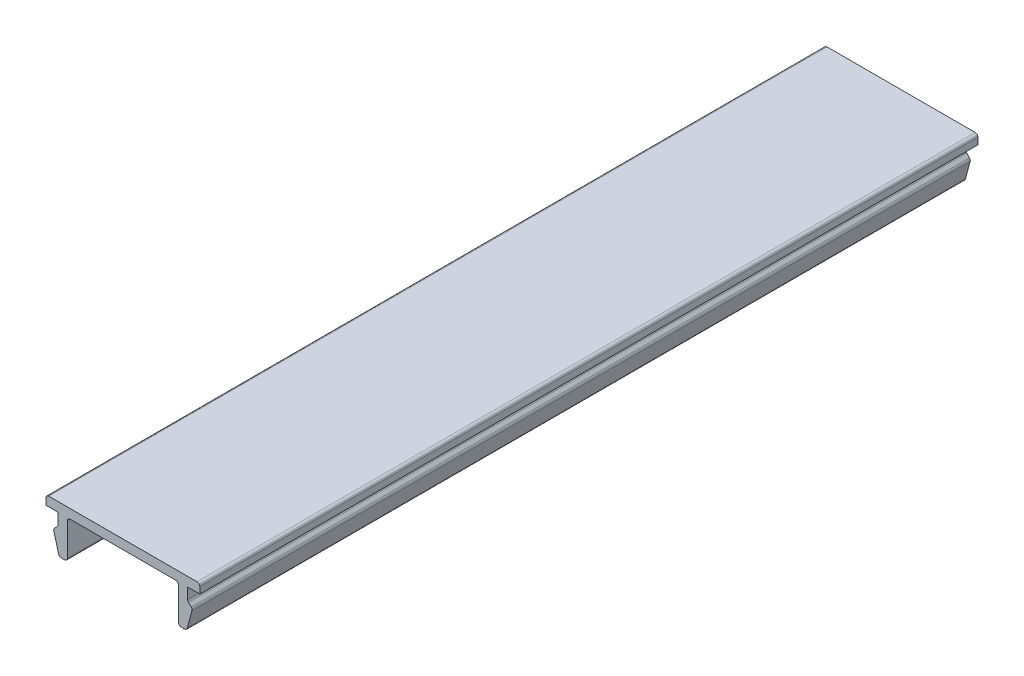
ISO-10303-21;
HEADER;
FILE_DESCRIPTION(('STEP AP214'),'2;1');
FILE_NAME('part.step','',(''),(''),'','','');
FILE_SCHEMA(('AUTOMOTIVE_DESIGN { 1 0 10303 214 1 1 1 1 }'));
ENDSEC;
DATA;
#1=APPLICATION_CONTEXT('core data for automotive mechanical design processes');
#2=APPLICATION_PROTOCOL_DEFINITION('international standard','automotive_design',2000,#1);
#3=PRODUCT_CONTEXT('',#1,'mechanical');
#4=PRODUCT('Part','Part','',(#3));
#5=PRODUCT_RELATED_PRODUCT_CATEGORY('part','',(#4));
#6=PRODUCT_DEFINITION_FORMATION('','',#4);
#7=PRODUCT_DEFINITION_CONTEXT('part definition',#1,'design');
#8=PRODUCT_DEFINITION('design','',#6,#7);
#9=PRODUCT_DEFINITION_SHAPE('','',#8);
#10=(LENGTH_UNIT() NAMED_UNIT(*) SI_UNIT(.MILLI.,.METRE.));
#11=(NAMED_UNIT(*) PLANE_ANGLE_UNIT() SI_UNIT($,.RADIAN.));
#12=(NAMED_UNIT(*) SI_UNIT($,.STERADIAN.) SOLID_ANGLE_UNIT());
#13=UNCERTAINTY_MEASURE_WITH_UNIT(LENGTH_MEASURE(1.E-05),#10,'distance_accuracy_value','');
#14=(GEOMETRIC_REPRESENTATION_CONTEXT(3) GLOBAL_UNCERTAINTY_ASSIGNED_CONTEXT((#13)) GLOBAL_UNIT_ASSIGNED_CONTEXT((#10,
#11,#12)) REPRESENTATION_CONTEXT('',''));
#15=CARTESIAN_POINT('',(0.,0.,0.));
#16=DIRECTION('',(0.,0.,1.));
#17=DIRECTION('',(1.,0.,0.));
#18=AXIS2_PLACEMENT_3D('',#15,#16,#17);
#19=CARTESIAN_POINT('',(-8.3,1.,84.));
#20=DIRECTION('',(1.,0.,0.));
#21=DIRECTION('',(0.,0.,-1.));
#22=AXIS2_PLACEMENT_3D('',#19,#20,#21);
#23=PLANE('',#22);
#24=DIRECTION('',(0.,-1.,0.));
#25=VECTOR('',#24,1.);
#26=CARTESIAN_POINT('',(-8.3,1.,84.));
#27=LINE('',#26,#25);
#28=CARTESIAN_POINT('',(-8.3,0.7,84.));
#29=VERTEX_POINT('',#28);
#30=CARTESIAN_POINT('',(-8.3,0.,84.));
#31=VERTEX_POINT('',#30);
#32=EDGE_CURVE('E224',#29,#31,#27,.T.);
#33=ORIENTED_EDGE('',*,*,#32,.F.);
#34=DIRECTION('',(0.,0.,-1.));
#35=VECTOR('',#34,1.);
#36=CARTESIAN_POINT('',(-8.3,0.7,84.));
#37=LINE('',#36,#35);
#38=CARTESIAN_POINT('',(-8.3,0.7,0.));
#39=VERTEX_POINT('',#38);
#40=EDGE_CURVE('E387',#29,#39,#37,.T.);
#41=ORIENTED_EDGE('',*,*,#40,.T.);
#42=DIRECTION('',(0.,-1.,0.));
#43=VECTOR('',#42,1.);
#44=CARTESIAN_POINT('',(-8.3,1.,0.));
#45=LINE('',#44,#43);
#46=CARTESIAN_POINT('',(-8.3,0.,0.));
#47=VERTEX_POINT('',#46);
#48=EDGE_CURVE('E252',#39,#47,#45,.T.);
#49=ORIENTED_EDGE('',*,*,#48,.T.);
#50=DIRECTION('',(0.,0.,-1.));
#51=VECTOR('',#50,1.);
#52=CARTESIAN_POINT('',(-8.3,0.,84.));
#53=LINE('',#52,#51);
#54=EDGE_CURVE('E244',#31,#47,#53,.T.);
#55=ORIENTED_EDGE('',*,*,#54,.F.);
#56=EDGE_LOOP('',(#33,#41,#49,#55));
#57=FACE_BOUND('',#56,.T.);
#58=ADVANCED_FACE('F39',(#57),#23,.F.);
#59=CARTESIAN_POINT('',(-8.3,0.,84.));
#60=DIRECTION('',(0.,1.,0.));
#61=DIRECTION('',(0.,0.,1.));
#62=AXIS2_PLACEMENT_3D('',#59,#60,#61);
#63=PLANE('',#62);
#64=DIRECTION('',(1.,0.,0.));
#65=VECTOR('',#64,1.);
#66=CARTESIAN_POINT('',(-8.3,0.,0.));
#67=LINE('',#66,#65);
#68=CARTESIAN_POINT('',(-7.,0.,0.));
#69=VERTEX_POINT('',#68);
#70=EDGE_CURVE('E422',#47,#69,#67,.T.);
#71=ORIENTED_EDGE('',*,*,#70,.T.);
#72=DIRECTION('',(0.,0.,-1.));
#73=VECTOR('',#72,1.);
#74=CARTESIAN_POINT('',(-7.,0.,84.));
#75=LINE('',#74,#73);
#76=CARTESIAN_POINT('',(-7.,0.,84.));
#77=VERTEX_POINT('',#76);
#78=EDGE_CURVE('E246',#77,#69,#75,.T.);
#79=ORIENTED_EDGE('',*,*,#78,.F.);
#80=DIRECTION('',(1.,0.,0.));
#81=VECTOR('',#80,1.);
#82=CARTESIAN_POINT('',(-8.3,0.,84.));
#83=LINE('',#82,#81);
#84=EDGE_CURVE('E229',#31,#77,#83,.T.);
#85=ORIENTED_EDGE('',*,*,#84,.F.);
#86=ORIENTED_EDGE('',*,*,#54,.T.);
#87=EDGE_LOOP('',(#71,#79,#85,#86));
#88=FACE_BOUND('',#87,.T.);
#89=ADVANCED_FACE('F243',(#88),#63,.F.);
#90=CARTESIAN_POINT('',(-7.,0.,84.));
#91=DIRECTION('',(1.,0.,0.));
#92=DIRECTION('',(0.,0.,-1.));
#93=AXIS2_PLACEMENT_3D('',#90,#91,#92);
#94=PLANE('',#93);
#95=DIRECTION('',(0.,-1.,0.));
#96=VECTOR('',#95,1.);
#97=CARTESIAN_POINT('',(-7.,0.,0.));
#98=LINE('',#97,#96);
#99=CARTESIAN_POINT('',(-7.,-1.17573593128807,0.));
#100=VERTEX_POINT('',#99);
#101=EDGE_CURVE('E413',#69,#100,#98,.T.);
#102=ORIENTED_EDGE('',*,*,#101,.T.);
#103=DIRECTION('',(0.,0.,-1.));
#104=VECTOR('',#103,1.);
#105=CARTESIAN_POINT('',(-7.,-1.17573593128807,84.));
#106=LINE('',#105,#104);
#107=CARTESIAN_POINT('',(-7.,-1.17573593128807,84.));
#108=VERTEX_POINT('',#107);
#109=EDGE_CURVE('E384',#100,#108,#106,.F.);
#110=ORIENTED_EDGE('',*,*,#109,.T.);
#111=DIRECTION('',(0.,-1.,0.));
#112=VECTOR('',#111,1.);
#113=CARTESIAN_POINT('',(-7.,0.,84.));
#114=LINE('',#113,#112);
#115=EDGE_CURVE('E249',#77,#108,#114,.T.);
#116=ORIENTED_EDGE('',*,*,#115,.F.);
#117=ORIENTED_EDGE('',*,*,#78,.T.);
#118=EDGE_LOOP('',(#102,#110,#116,#117));
#119=FACE_BOUND('',#118,.T.);
#120=ADVANCED_FACE('F420',(#119),#94,.F.);
#121=CARTESIAN_POINT('',(-7.,-1.3,84.));
#122=DIRECTION('',(0.707106781186546,-0.707106781186548,0.));
#123=DIRECTION('',(0.707106781186548,0.707106781186547,0.));
#124=AXIS2_PLACEMENT_3D('',#121,#122,#123);
#125=PLANE('',#124);
#126=DIRECTION('',(-0.707106781186548,-0.707106781186547,0.));
#127=VECTOR('',#126,1.);
#128=CARTESIAN_POINT('',(-7.,-1.3,0.));
#129=LINE('',#128,#127);
#130=CARTESIAN_POINT('',(-7.08786796564404,-1.38786796564404,0.));
#131=VERTEX_POINT('',#130);
#132=CARTESIAN_POINT('',(-7.37752551286084,-1.67752551286084,0.));
#133=VERTEX_POINT('',#132);
#134=EDGE_CURVE('E415',#131,#133,#129,.T.);
#135=ORIENTED_EDGE('',*,*,#134,.T.);
#136=DIRECTION('',(0.,0.,-1.));
#137=VECTOR('',#136,1.);
#138=CARTESIAN_POINT('',(-7.37752551286084,-1.67752551286084,84.));
#139=LINE('',#138,#137);
#140=CARTESIAN_POINT('',(-7.37752551286084,-1.67752551286084,84.));
#141=VERTEX_POINT('',#140);
#142=EDGE_CURVE('E381',#133,#141,#139,.F.);
#143=ORIENTED_EDGE('',*,*,#142,.T.);
#144=DIRECTION('',(-0.707106781186548,-0.707106781186547,0.));
#145=VECTOR('',#144,1.);
#146=CARTESIAN_POINT('',(-7.,-1.3,84.));
#147=LINE('',#146,#145);
#148=CARTESIAN_POINT('',(-7.08786796564404,-1.38786796564404,84.));
#149=VERTEX_POINT('',#148);
#150=EDGE_CURVE('E428',#149,#141,#147,.T.);
#151=ORIENTED_EDGE('',*,*,#150,.F.);
#152=DIRECTION('',(0.,0.,-1.));
#153=VECTOR('',#152,1.);
#154=CARTESIAN_POINT('',(-7.08786796564404,-1.38786796564404,0.));
#155=LINE('',#154,#153);
#156=EDGE_CURVE('E377',#149,#131,#155,.T.);
#157=ORIENTED_EDGE('',*,*,#156,.T.);
#158=EDGE_LOOP('',(#135,#143,#151,#157));
#159=FACE_BOUND('',#158,.T.);
#160=ADVANCED_FACE('F431',(#159),#125,.F.);
#161=CARTESIAN_POINT('',(-7.5,-1.8,84.));
#162=DIRECTION('',(0.965925826289068,0.258819045102522,0.));
#163=DIRECTION('',(-0.258819045102522,0.965925826289068,0.));
#164=AXIS2_PLACEMENT_3D('',#161,#162,#163);
#165=PLANE('',#164);
#166=DIRECTION('',(0.258819045102522,-0.965925826289068,0.));
#167=VECTOR('',#166,1.);
#168=CARTESIAN_POINT('',(-7.5,-1.8,0.));
#169=LINE('',#168,#167);
#170=CARTESIAN_POINT('',(-7.4551712263916,-1.96730326074756,0.));
#171=VERTEX_POINT('',#170);
#172=CARTESIAN_POINT('',(-6.94329650890145,-3.87764571353076,0.));
#173=VERTEX_POINT('',#172);
#174=EDGE_CURVE('E488',#171,#173,#169,.T.);
#175=ORIENTED_EDGE('',*,*,#174,.T.);
#176=DIRECTION('',(0.,0.,-1.));
#177=VECTOR('',#176,1.);
#178=CARTESIAN_POINT('',(-6.94329650890145,-3.87764571353076,84.));
#179=LINE('',#178,#177);
#180=CARTESIAN_POINT('',(-6.94329650890145,-3.87764571353076,84.));
#181=VERTEX_POINT('',#180);
#182=EDGE_CURVE('E374',#173,#181,#179,.F.);
#183=ORIENTED_EDGE('',*,*,#182,.T.);
#184=DIRECTION('',(0.258819045102522,-0.965925826289068,0.));
#185=VECTOR('',#184,1.);
#186=CARTESIAN_POINT('',(-7.5,-1.8,84.));
#187=LINE('',#186,#185);
#188=CARTESIAN_POINT('',(-7.4551712263916,-1.96730326074756,84.));
#189=VERTEX_POINT('',#188);
#190=EDGE_CURVE('E434',#189,#181,#187,.T.);
#191=ORIENTED_EDGE('',*,*,#190,.F.);
#192=DIRECTION('',(0.,0.,-1.));
#193=VECTOR('',#192,1.);
#194=CARTESIAN_POINT('',(-7.4551712263916,-1.96730326074756,84.));
#195=LINE('',#194,#193);
#196=EDGE_CURVE('E370',#189,#171,#195,.T.);
#197=ORIENTED_EDGE('',*,*,#196,.T.);
#198=EDGE_LOOP('',(#175,#183,#191,#197));
#199=FACE_BOUND('',#198,.T.);
#200=ADVANCED_FACE('F613',(#199),#165,.F.);
#201=CARTESIAN_POINT('',(-6.,-4.1,84.));
#202=DIRECTION('',(0.,1.,0.));
#203=DIRECTION('',(0.,0.,1.));
#204=AXIS2_PLACEMENT_3D('',#201,#202,#203);
#205=PLANE('',#204);
#206=DIRECTION('',(1.,0.,0.));
#207=VECTOR('',#206,1.);
#208=CARTESIAN_POINT('',(-6.,-4.1,0.));
#209=LINE('',#208,#207);
#210=CARTESIAN_POINT('',(-6.65351876101473,-4.1,0.));
#211=VERTEX_POINT('',#210);
#212=CARTESIAN_POINT('',(-6.3,-4.1,0.));
#213=VERTEX_POINT('',#212);
#214=EDGE_CURVE('E492',#211,#213,#209,.T.);
#215=ORIENTED_EDGE('',*,*,#214,.T.);
#216=DIRECTION('',(0.,0.,-1.));
#217=VECTOR('',#216,1.);
#218=CARTESIAN_POINT('',(-6.3,-4.1,84.));
#219=LINE('',#218,#217);
#220=CARTESIAN_POINT('',(-6.3,-4.1,84.));
#221=VERTEX_POINT('',#220);
#222=EDGE_CURVE('E367',#213,#221,#219,.F.);
#223=ORIENTED_EDGE('',*,*,#222,.T.);
#224=DIRECTION('',(1.,0.,0.));
#225=VECTOR('',#224,1.);
#226=CARTESIAN_POINT('',(-6.,-4.1,84.));
#227=LINE('',#226,#225);
#228=CARTESIAN_POINT('',(-6.65351876101473,-4.1,84.));
#229=VERTEX_POINT('',#228);
#230=EDGE_CURVE('E439',#229,#221,#227,.T.);
#231=ORIENTED_EDGE('',*,*,#230,.F.);
#232=DIRECTION('',(0.,0.,-1.));
#233=VECTOR('',#232,1.);
#234=CARTESIAN_POINT('',(-6.65351876101473,-4.1,84.));
#235=LINE('',#234,#233);
#236=EDGE_CURVE('E363',#229,#211,#235,.T.);
#237=ORIENTED_EDGE('',*,*,#236,.T.);
#238=EDGE_LOOP('',(#215,#223,#231,#237));
#239=FACE_BOUND('',#238,.T.);
#240=ADVANCED_FACE('F620',(#239),#205,.F.);
#241=CARTESIAN_POINT('',(-6.,0.,84.));
#242=DIRECTION('',(-1.,0.,0.));
#243=DIRECTION('',(0.,-1.,0.));
#244=AXIS2_PLACEMENT_3D('',#241,#242,#243);
#245=PLANE('',#244);
#246=DIRECTION('',(0.,1.,0.));
#247=VECTOR('',#246,1.);
#248=CARTESIAN_POINT('',(-6.,0.,0.));
#249=LINE('',#248,#247);
#250=CARTESIAN_POINT('',(-6.,-3.8,0.));
#251=VERTEX_POINT('',#250);
#252=CARTESIAN_POINT('',(-6.,-0.3,0.));
#253=VERTEX_POINT('',#252);
#254=EDGE_CURVE('E496',#251,#253,#249,.T.);
#255=ORIENTED_EDGE('',*,*,#254,.T.);
#256=DIRECTION('',(0.,0.,-1.));
#257=VECTOR('',#256,1.);
#258=CARTESIAN_POINT('',(-6.,-0.3,84.));
#259=LINE('',#258,#257);
#260=CARTESIAN_POINT('',(-6.,-0.3,84.));
#261=VERTEX_POINT('',#260);
#262=EDGE_CURVE('E360',#253,#261,#259,.F.);
#263=ORIENTED_EDGE('',*,*,#262,.T.);
#264=DIRECTION('',(0.,1.,0.));
#265=VECTOR('',#264,1.);
#266=CARTESIAN_POINT('',(-6.,0.,84.));
#267=LINE('',#266,#265);
#268=CARTESIAN_POINT('',(-6.,-3.8,84.));
#269=VERTEX_POINT('',#268);
#270=EDGE_CURVE('E446',#269,#261,#267,.T.);
#271=ORIENTED_EDGE('',*,*,#270,.F.);
#272=DIRECTION('',(0.,0.,-1.));
#273=VECTOR('',#272,1.);
#274=CARTESIAN_POINT('',(-6.,-3.8,84.));
#275=LINE('',#274,#273);
#276=EDGE_CURVE('E356',#269,#251,#275,.T.);
#277=ORIENTED_EDGE('',*,*,#276,.T.);
#278=EDGE_LOOP('',(#255,#263,#271,#277));
#279=FACE_BOUND('',#278,.T.);
#280=ADVANCED_FACE('F627',(#279),#245,.F.);
#281=CARTESIAN_POINT('',(-6.,0.,84.));
#282=DIRECTION('',(0.,1.,0.));
#283=DIRECTION('',(0.,0.,1.));
#284=AXIS2_PLACEMENT_3D('',#281,#282,#283);
#285=PLANE('',#284);
#286=DIRECTION('',(1.,0.,0.));
#287=VECTOR('',#286,1.);
#288=CARTESIAN_POINT('',(-6.,0.,0.));
#289=LINE('',#288,#287);
#290=CARTESIAN_POINT('',(-5.7,0.,0.));
#291=VERTEX_POINT('',#290);
#292=CARTESIAN_POINT('',(5.69999999999999,0.,0.));
#293=VERTEX_POINT('',#292);
#294=EDGE_CURVE('E500',#291,#293,#289,.T.);
#295=ORIENTED_EDGE('',*,*,#294,.T.);
#296=DIRECTION('',(0.,0.,-1.));
#297=VECTOR('',#296,1.);
#298=CARTESIAN_POINT('',(5.69999999999999,0.,84.));
#299=LINE('',#298,#297);
#300=CARTESIAN_POINT('',(5.69999999999999,0.,84.));
#301=VERTEX_POINT('',#300);
#302=EDGE_CURVE('E353',#293,#301,#299,.F.);
#303=ORIENTED_EDGE('',*,*,#302,.T.);
#304=DIRECTION('',(1.,0.,0.));
#305=VECTOR('',#304,1.);
#306=CARTESIAN_POINT('',(-6.,0.,84.));
#307=LINE('',#306,#305);
#308=CARTESIAN_POINT('',(-5.7,0.,84.));
#309=VERTEX_POINT('',#308);
#310=EDGE_CURVE('E450',#309,#301,#307,.T.);
#311=ORIENTED_EDGE('',*,*,#310,.F.);
#312=DIRECTION('',(0.,0.,-1.));
#313=VECTOR('',#312,1.);
#314=CARTESIAN_POINT('',(-5.7,0.,0.));
#315=LINE('',#314,#313);
#316=EDGE_CURVE('E349',#309,#291,#315,.T.);
#317=ORIENTED_EDGE('',*,*,#316,.T.);
#318=EDGE_LOOP('',(#295,#303,#311,#317));
#319=FACE_BOUND('',#318,.T.);
#320=ADVANCED_FACE('F634',(#319),#285,.F.);
#321=CARTESIAN_POINT('',(5.99999999999999,0.,84.));
#322=DIRECTION('',(1.,0.,0.));
#323=DIRECTION('',(0.,1.,0.));
#324=AXIS2_PLACEMENT_3D('',#321,#322,#323);
#325=PLANE('',#324);
#326=DIRECTION('',(0.,-1.,0.));
#327=VECTOR('',#326,1.);
#328=CARTESIAN_POINT('',(5.99999999999999,0.,0.));
#329=LINE('',#328,#327);
#330=CARTESIAN_POINT('',(5.99999999999999,-0.3,0.));
#331=VERTEX_POINT('',#330);
#332=CARTESIAN_POINT('',(5.99999999999999,-3.8,0.));
#333=VERTEX_POINT('',#332);
#334=EDGE_CURVE('E504',#331,#333,#329,.T.);
#335=ORIENTED_EDGE('',*,*,#334,.T.);
#336=DIRECTION('',(0.,0.,-1.));
#337=VECTOR('',#336,1.);
#338=CARTESIAN_POINT('',(5.99999999999999,-3.8,84.));
#339=LINE('',#338,#337);
#340=CARTESIAN_POINT('',(5.99999999999999,-3.8,84.));
#341=VERTEX_POINT('',#340);
#342=EDGE_CURVE('E346',#333,#341,#339,.F.);
#343=ORIENTED_EDGE('',*,*,#342,.T.);
#344=DIRECTION('',(0.,-1.,0.));
#345=VECTOR('',#344,1.);
#346=CARTESIAN_POINT('',(5.99999999999999,0.,84.));
#347=LINE('',#346,#345);
#348=CARTESIAN_POINT('',(5.99999999999999,-0.3,84.));
#349=VERTEX_POINT('',#348);
#350=EDGE_CURVE('E454',#349,#341,#347,.T.);
#351=ORIENTED_EDGE('',*,*,#350,.F.);
#352=DIRECTION('',(0.,0.,-1.));
#353=VECTOR('',#352,1.);
#354=CARTESIAN_POINT('',(5.99999999999999,-0.3,0.));
#355=LINE('',#354,#353);
#356=EDGE_CURVE('E342',#349,#331,#355,.T.);
#357=ORIENTED_EDGE('',*,*,#356,.T.);
#358=EDGE_LOOP('',(#335,#343,#351,#357));
#359=FACE_BOUND('',#358,.T.);
#360=ADVANCED_FACE('F641',(#359),#325,.F.);
#361=CARTESIAN_POINT('',(5.99999999999999,-4.1,84.));
#362=DIRECTION('',(0.,1.,0.));
#363=DIRECTION('',(0.,0.,1.));
#364=AXIS2_PLACEMENT_3D('',#361,#362,#363);
#365=PLANE('',#364);
#366=DIRECTION('',(1.,0.,0.));
#367=VECTOR('',#366,1.);
#368=CARTESIAN_POINT('',(5.99999999999999,-4.1,0.));
#369=LINE('',#368,#367);
#370=CARTESIAN_POINT('',(6.29999999999999,-4.1,0.));
#371=VERTEX_POINT('',#370);
#372=CARTESIAN_POINT('',(6.65351876101472,-4.1,0.));
#373=VERTEX_POINT('',#372);
#374=EDGE_CURVE('E508',#371,#373,#369,.T.);
#375=ORIENTED_EDGE('',*,*,#374,.T.);
#376=DIRECTION('',(0.,0.,-1.));
#377=VECTOR('',#376,1.);
#378=CARTESIAN_POINT('',(6.65351876101472,-4.1,84.));
#379=LINE('',#378,#377);
#380=CARTESIAN_POINT('',(6.65351876101472,-4.1,84.));
#381=VERTEX_POINT('',#380);
#382=EDGE_CURVE('E339',#373,#381,#379,.F.);
#383=ORIENTED_EDGE('',*,*,#382,.T.);
#384=DIRECTION('',(1.,0.,0.));
#385=VECTOR('',#384,1.);
#386=CARTESIAN_POINT('',(5.99999999999999,-4.1,84.));
#387=LINE('',#386,#385);
#388=CARTESIAN_POINT('',(6.29999999999999,-4.1,84.));
#389=VERTEX_POINT('',#388);
#390=EDGE_CURVE('E458',#389,#381,#387,.T.);
#391=ORIENTED_EDGE('',*,*,#390,.F.);
#392=DIRECTION('',(0.,0.,-1.));
#393=VECTOR('',#392,1.);
#394=CARTESIAN_POINT('',(6.29999999999999,-4.1,84.));
#395=LINE('',#394,#393);
#396=EDGE_CURVE('E335',#389,#371,#395,.T.);
#397=ORIENTED_EDGE('',*,*,#396,.T.);
#398=EDGE_LOOP('',(#375,#383,#391,#397));
#399=FACE_BOUND('',#398,.T.);
#400=ADVANCED_FACE('F648',(#399),#365,.F.);
#401=CARTESIAN_POINT('',(7.49999999999999,-1.8,84.));
#402=DIRECTION('',(-0.965925826289068,0.258819045102522,0.));
#403=DIRECTION('',(-0.258819045102522,-0.965925826289068,0.));
#404=AXIS2_PLACEMENT_3D('',#401,#402,#403);
#405=PLANE('',#404);
#406=DIRECTION('',(0.258819045102522,0.965925826289068,0.));
#407=VECTOR('',#406,1.);
#408=CARTESIAN_POINT('',(7.49999999999999,-1.8,0.));
#409=LINE('',#408,#407);
#410=CARTESIAN_POINT('',(6.94329650890144,-3.87764571353075,0.));
#411=VERTEX_POINT('',#410);
#412=CARTESIAN_POINT('',(7.45517122639159,-1.96730326074756,0.));
#413=VERTEX_POINT('',#412);
#414=EDGE_CURVE('E512',#411,#413,#409,.T.);
#415=ORIENTED_EDGE('',*,*,#414,.T.);
#416=DIRECTION('',(0.,0.,-1.));
#417=VECTOR('',#416,1.);
#418=CARTESIAN_POINT('',(7.45517122639159,-1.96730326074756,84.));
#419=LINE('',#418,#417);
#420=CARTESIAN_POINT('',(7.45517122639159,-1.96730326074756,84.));
#421=VERTEX_POINT('',#420);
#422=EDGE_CURVE('E332',#413,#421,#419,.F.);
#423=ORIENTED_EDGE('',*,*,#422,.T.);
#424=DIRECTION('',(0.258819045102522,0.965925826289068,0.));
#425=VECTOR('',#424,1.);
#426=CARTESIAN_POINT('',(7.49999999999999,-1.8,84.));
#427=LINE('',#426,#425);
#428=CARTESIAN_POINT('',(6.94329650890144,-3.87764571353075,84.));
#429=VERTEX_POINT('',#428);
#430=EDGE_CURVE('E462',#429,#421,#427,.T.);
#431=ORIENTED_EDGE('',*,*,#430,.F.);
#432=DIRECTION('',(0.,0.,-1.));
#433=VECTOR('',#432,1.);
#434=CARTESIAN_POINT('',(6.94329650890144,-3.87764571353075,84.));
#435=LINE('',#434,#433);
#436=EDGE_CURVE('E328',#429,#411,#435,.T.);
#437=ORIENTED_EDGE('',*,*,#436,.T.);
#438=EDGE_LOOP('',(#415,#423,#431,#437));
#439=FACE_BOUND('',#438,.T.);
#440=ADVANCED_FACE('F655',(#439),#405,.F.);
#441=CARTESIAN_POINT('',(6.99999999999999,-1.3,84.));
#442=DIRECTION('',(-0.707106781186546,-0.707106781186548,0.));
#443=DIRECTION('',(0.707106781186548,-0.707106781186547,0.));
#444=AXIS2_PLACEMENT_3D('',#441,#442,#443);
#445=PLANE('',#444);
#446=DIRECTION('',(-0.707106781186548,0.707106781186547,0.));
#447=VECTOR('',#446,1.);
#448=CARTESIAN_POINT('',(6.99999999999999,-1.3,0.));
#449=LINE('',#448,#447);
#450=CARTESIAN_POINT('',(7.37752551286083,-1.67752551286084,0.));
#451=VERTEX_POINT('',#450);
#452=CARTESIAN_POINT('',(7.08786796564403,-1.38786796564403,0.));
#453=VERTEX_POINT('',#452);
#454=EDGE_CURVE('E516',#451,#453,#449,.T.);
#455=ORIENTED_EDGE('',*,*,#454,.T.);
#456=DIRECTION('',(0.,0.,-1.));
#457=VECTOR('',#456,1.);
#458=CARTESIAN_POINT('',(7.08786796564403,-1.38786796564403,84.));
#459=LINE('',#458,#457);
#460=CARTESIAN_POINT('',(7.08786796564403,-1.38786796564403,84.));
#461=VERTEX_POINT('',#460);
#462=EDGE_CURVE('E63',#453,#461,#459,.F.);
#463=ORIENTED_EDGE('',*,*,#462,.T.);
#464=DIRECTION('',(-0.707106781186548,0.707106781186547,0.));
#465=VECTOR('',#464,1.);
#466=CARTESIAN_POINT('',(6.99999999999999,-1.3,84.));
#467=LINE('',#466,#465);
#468=CARTESIAN_POINT('',(7.37752551286083,-1.67752551286084,84.));
#469=VERTEX_POINT('',#468);
#470=EDGE_CURVE('E466',#469,#461,#467,.T.);
#471=ORIENTED_EDGE('',*,*,#470,.F.);
#472=DIRECTION('',(0.,0.,-1.));
#473=VECTOR('',#472,1.);
#474=CARTESIAN_POINT('',(7.37752551286083,-1.67752551286084,84.));
#475=LINE('',#474,#473);
#476=EDGE_CURVE('E322',#469,#451,#475,.T.);
#477=ORIENTED_EDGE('',*,*,#476,.T.);
#478=EDGE_LOOP('',(#455,#463,#471,#477));
#479=FACE_BOUND('',#478,.T.);
#480=ADVANCED_FACE('F659',(#479),#445,.F.);
#481=CARTESIAN_POINT('',(6.99999999999999,0.,84.));
#482=DIRECTION('',(-1.,0.,0.));
#483=DIRECTION('',(0.,0.,1.));
#484=AXIS2_PLACEMENT_3D('',#481,#482,#483);
#485=PLANE('',#484);
#486=DIRECTION('',(0.,1.,0.));
#487=VECTOR('',#486,1.);
#488=CARTESIAN_POINT('',(6.99999999999999,0.,84.));
#489=LINE('',#488,#487);
#490=CARTESIAN_POINT('',(6.99999999999999,-1.17573593128807,84.));
#491=VERTEX_POINT('',#490);
#492=CARTESIAN_POINT('',(6.99999999999999,0.,84.));
#493=VERTEX_POINT('',#492);
#494=EDGE_CURVE('E469',#491,#493,#489,.T.);
#495=ORIENTED_EDGE('',*,*,#494,.F.);
#496=DIRECTION('',(0.,0.,-1.));
#497=VECTOR('',#496,1.);
#498=CARTESIAN_POINT('',(6.99999999999999,-1.17573593128807,0.));
#499=LINE('',#498,#497);
#500=CARTESIAN_POINT('',(6.99999999999999,-1.17573593128807,0.));
#501=VERTEX_POINT('',#500);
#502=EDGE_CURVE('E318',#491,#501,#499,.T.);
#503=ORIENTED_EDGE('',*,*,#502,.T.);
#504=DIRECTION('',(0.,1.,0.));
#505=VECTOR('',#504,1.);
#506=CARTESIAN_POINT('',(6.99999999999999,0.,0.));
#507=LINE('',#506,#505);
#508=CARTESIAN_POINT('',(6.99999999999999,0.,0.));
#509=VERTEX_POINT('',#508);
#510=EDGE_CURVE('E519',#501,#509,#507,.T.);
#511=ORIENTED_EDGE('',*,*,#510,.T.);
#512=DIRECTION('',(0.,0.,-1.));
#513=VECTOR('',#512,1.);
#514=CARTESIAN_POINT('',(6.99999999999999,0.,84.));
#515=LINE('',#514,#513);
#516=EDGE_CURVE('E261',#493,#509,#515,.T.);
#517=ORIENTED_EDGE('',*,*,#516,.F.);
#518=EDGE_LOOP('',(#495,#503,#511,#517));
#519=FACE_BOUND('',#518,.T.);
#520=ADVANCED_FACE('F662',(#519),#485,.F.);
#521=CARTESIAN_POINT('',(6.99999999999999,0.,84.));
#522=DIRECTION('',(0.,1.,0.));
#523=DIRECTION('',(0.,0.,1.));
#524=AXIS2_PLACEMENT_3D('',#521,#522,#523);
#525=PLANE('',#524);
#526=DIRECTION('',(1.,0.,0.));
#527=VECTOR('',#526,1.);
#528=CARTESIAN_POINT('',(6.99999999999999,0.,0.));
#529=LINE('',#528,#527);
#530=CARTESIAN_POINT('',(8.3,0.,0.));
#531=VERTEX_POINT('',#530);
#532=EDGE_CURVE('E522',#509,#531,#529,.T.);
#533=ORIENTED_EDGE('',*,*,#532,.T.);
#534=DIRECTION('',(0.,0.,-1.));
#535=VECTOR('',#534,1.);
#536=CARTESIAN_POINT('',(8.3,0.,84.));
#537=LINE('',#536,#535);
#538=CARTESIAN_POINT('',(8.3,0.,84.));
#539=VERTEX_POINT('',#538);
#540=EDGE_CURVE('E481',#539,#531,#537,.T.);
#541=ORIENTED_EDGE('',*,*,#540,.F.);
#542=DIRECTION('',(1.,0.,0.));
#543=VECTOR('',#542,1.);
#544=CARTESIAN_POINT('',(6.99999999999999,0.,84.));
#545=LINE('',#544,#543);
#546=EDGE_CURVE('E472',#493,#539,#545,.T.);
#547=ORIENTED_EDGE('',*,*,#546,.F.);
#548=ORIENTED_EDGE('',*,*,#516,.T.);
#549=EDGE_LOOP('',(#533,#541,#547,#548));
#550=FACE_BOUND('',#549,.T.);
#551=ADVANCED_FACE('F540',(#550),#525,.F.);
#552=CARTESIAN_POINT('',(8.3,1.,84.));
#553=DIRECTION('',(-1.,0.,0.));
#554=DIRECTION('',(0.,0.,1.));
#555=AXIS2_PLACEMENT_3D('',#552,#553,#554);
#556=PLANE('',#555);
#557=DIRECTION('',(0.,1.,0.));
#558=VECTOR('',#557,1.);
#559=CARTESIAN_POINT('',(8.3,1.,0.));
#560=LINE('',#559,#558);
#561=CARTESIAN_POINT('',(8.3,0.700000000000004,0.));
#562=VERTEX_POINT('',#561);
#563=EDGE_CURVE('E525',#531,#562,#560,.T.);
#564=ORIENTED_EDGE('',*,*,#563,.T.);
#565=DIRECTION('',(0.,0.,-1.));
#566=VECTOR('',#565,1.);
#567=CARTESIAN_POINT('',(8.3,0.700000000000004,84.));
#568=LINE('',#567,#566);
#569=CARTESIAN_POINT('',(8.3,0.700000000000004,84.));
#570=VERTEX_POINT('',#569);
#571=EDGE_CURVE('E292',#562,#570,#568,.F.);
#572=ORIENTED_EDGE('',*,*,#571,.T.);
#573=DIRECTION('',(0.,1.,0.));
#574=VECTOR('',#573,1.);
#575=CARTESIAN_POINT('',(8.3,1.,84.));
#576=LINE('',#575,#574);
#577=EDGE_CURVE('E475',#539,#570,#576,.T.);
#578=ORIENTED_EDGE('',*,*,#577,.F.);
#579=ORIENTED_EDGE('',*,*,#540,.T.);
#580=EDGE_LOOP('',(#564,#572,#578,#579));
#581=FACE_BOUND('',#580,.T.);
#582=ADVANCED_FACE('F547',(#581),#556,.F.);
#583=CARTESIAN_POINT('',(-8.3,1.,84.));
#584=DIRECTION('',(0.,-1.,0.));
#585=DIRECTION('',(1.,0.,0.));
#586=AXIS2_PLACEMENT_3D('',#583,#584,#585);
#587=PLANE('',#586);
#588=DIRECTION('',(-1.,0.,0.));
#589=VECTOR('',#588,1.);
#590=CARTESIAN_POINT('',(-8.3,1.,84.));
#591=LINE('',#590,#589);
#592=CARTESIAN_POINT('',(7.99999999999999,1.,84.));
#593=VERTEX_POINT('',#592);
#594=CARTESIAN_POINT('',(-8.,1.,84.));
#595=VERTEX_POINT('',#594);
#596=EDGE_CURVE('E478',#593,#595,#591,.T.);
#597=ORIENTED_EDGE('',*,*,#596,.F.);
#598=DIRECTION('',(0.,0.,-1.));
#599=VECTOR('',#598,1.);
#600=CARTESIAN_POINT('',(8.,1.,84.));
#601=LINE('',#600,#599);
#602=CARTESIAN_POINT('',(7.99999999999999,1.,0.));
#603=VERTEX_POINT('',#602);
#604=EDGE_CURVE('E259',#593,#603,#601,.T.);
#605=ORIENTED_EDGE('',*,*,#604,.T.);
#606=DIRECTION('',(-1.,0.,0.));
#607=VECTOR('',#606,1.);
#608=CARTESIAN_POINT('',(-8.3,1.,0.));
#609=LINE('',#608,#607);
#610=CARTESIAN_POINT('',(-8.,1.,0.));
#611=VERTEX_POINT('',#610);
#612=EDGE_CURVE('E239',#603,#611,#609,.T.);
#613=ORIENTED_EDGE('',*,*,#612,.T.);
#614=DIRECTION('',(0.,0.,-1.));
#615=VECTOR('',#614,1.);
#616=CARTESIAN_POINT('',(-8.,1.,84.));
#617=LINE('',#616,#615);
#618=EDGE_CURVE('E255',#611,#595,#617,.F.);
#619=ORIENTED_EDGE('',*,*,#618,.T.);
#620=EDGE_LOOP('',(#597,#605,#613,#619));
#621=FACE_BOUND('',#620,.T.);
#622=ADVANCED_FACE('F555',(#621),#587,.F.);
#623=CARTESIAN_POINT('',(0.,0.,84.));
#624=DIRECTION('',(0.,0.,1.));
#625=DIRECTION('',(1.,0.,0.));
#626=AXIS2_PLACEMENT_3D('',#623,#624,#625);
#627=PLANE('',#626);
#628=ORIENTED_EDGE('',*,*,#577,.T.);
#629=CARTESIAN_POINT('',(8.,0.700000000000004,84.));
#630=DIRECTION('',(0.,0.,1.));
#631=DIRECTION('',(1.,0.,0.));
#632=AXIS2_PLACEMENT_3D('',#629,#630,#631);
#633=CIRCLE('',#632,0.3);
#634=EDGE_CURVE('E315',#570,#593,#633,.T.);
#635=ORIENTED_EDGE('',*,*,#634,.T.);
#636=ORIENTED_EDGE('',*,*,#596,.T.);
#637=CARTESIAN_POINT('',(-8.,0.7,84.));
#638=DIRECTION('',(0.,0.,1.));
#639=DIRECTION('',(1.,0.,0.));
#640=AXIS2_PLACEMENT_3D('',#637,#638,#639);
#641=CIRCLE('',#640,0.3);
#642=EDGE_CURVE('E233',#595,#29,#641,.T.);
#643=ORIENTED_EDGE('',*,*,#642,.T.);
#644=ORIENTED_EDGE('',*,*,#32,.T.);
#645=ORIENTED_EDGE('',*,*,#84,.T.);
#646=ORIENTED_EDGE('',*,*,#115,.T.);
#647=CARTESIAN_POINT('',(-7.3,-1.17573593128807,84.));
#648=DIRECTION('',(0.,0.,1.));
#649=DIRECTION('',(1.,0.,0.));
#650=AXIS2_PLACEMENT_3D('',#647,#648,#649);
#651=CIRCLE('',#650,0.3);
#652=EDGE_CURVE('E11',#108,#149,#651,.F.);
#653=ORIENTED_EDGE('',*,*,#652,.T.);
#654=ORIENTED_EDGE('',*,*,#150,.T.);
#655=CARTESIAN_POINT('',(-7.16539347850488,-1.8896575472168,84.));
#656=DIRECTION('',(0.,0.,1.));
#657=DIRECTION('',(1.,0.,0.));
#658=AXIS2_PLACEMENT_3D('',#655,#656,#657);
#659=CIRCLE('',#658,0.3);
#660=EDGE_CURVE('E297',#141,#189,#659,.T.);
#661=ORIENTED_EDGE('',*,*,#660,.T.);
#662=ORIENTED_EDGE('',*,*,#190,.T.);
#663=CARTESIAN_POINT('',(-6.65351876101473,-3.8,84.));
#664=DIRECTION('',(0.,0.,1.));
#665=DIRECTION('',(1.,0.,0.));
#666=AXIS2_PLACEMENT_3D('',#663,#664,#665);
#667=CIRCLE('',#666,0.3);
#668=EDGE_CURVE('E300',#181,#229,#667,.T.);
#669=ORIENTED_EDGE('',*,*,#668,.T.);
#670=ORIENTED_EDGE('',*,*,#230,.T.);
#671=CARTESIAN_POINT('',(-6.3,-3.8,84.));
#672=DIRECTION('',(0.,0.,1.));
#673=DIRECTION('',(1.,0.,0.));
#674=AXIS2_PLACEMENT_3D('',#671,#672,#673);
#675=CIRCLE('',#674,0.3);
#676=EDGE_CURVE('E303',#221,#269,#675,.T.);
#677=ORIENTED_EDGE('',*,*,#676,.T.);
#678=ORIENTED_EDGE('',*,*,#270,.T.);
#679=CARTESIAN_POINT('',(-5.7,-0.3,84.));
#680=DIRECTION('',(0.,0.,1.));
#681=DIRECTION('',(1.,0.,0.));
#682=AXIS2_PLACEMENT_3D('',#679,#680,#681);
#683=CIRCLE('',#682,0.3);
#684=EDGE_CURVE('E404',#261,#309,#683,.F.);
#685=ORIENTED_EDGE('',*,*,#684,.T.);
#686=ORIENTED_EDGE('',*,*,#310,.T.);
#687=CARTESIAN_POINT('',(5.69999999999999,-0.3,84.));
#688=DIRECTION('',(0.,0.,1.));
#689=DIRECTION('',(1.,0.,0.));
#690=AXIS2_PLACEMENT_3D('',#687,#688,#689);
#691=CIRCLE('',#690,0.3);
#692=EDGE_CURVE('E398',#301,#349,#691,.F.);
#693=ORIENTED_EDGE('',*,*,#692,.T.);
#694=ORIENTED_EDGE('',*,*,#350,.T.);
#695=CARTESIAN_POINT('',(6.29999999999999,-3.8,84.));
#696=DIRECTION('',(0.,0.,1.));
#697=DIRECTION('',(1.,0.,0.));
#698=AXIS2_PLACEMENT_3D('',#695,#696,#697);
#699=CIRCLE('',#698,0.3);
#700=EDGE_CURVE('E306',#341,#389,#699,.T.);
#701=ORIENTED_EDGE('',*,*,#700,.T.);
#702=ORIENTED_EDGE('',*,*,#390,.T.);
#703=CARTESIAN_POINT('',(6.65351876101472,-3.8,84.));
#704=DIRECTION('',(0.,0.,1.));
#705=DIRECTION('',(1.,0.,0.));
#706=AXIS2_PLACEMENT_3D('',#703,#704,#705);
#707=CIRCLE('',#706,0.3);
#708=EDGE_CURVE('E309',#381,#429,#707,.T.);
#709=ORIENTED_EDGE('',*,*,#708,.T.);
#710=ORIENTED_EDGE('',*,*,#430,.T.);
#711=CARTESIAN_POINT('',(7.16539347850487,-1.8896575472168,84.));
#712=DIRECTION('',(0.,0.,1.));
#713=DIRECTION('',(1.,0.,0.));
#714=AXIS2_PLACEMENT_3D('',#711,#712,#713);
#715=CIRCLE('',#714,0.3);
#716=EDGE_CURVE('E312',#421,#469,#715,.T.);
#717=ORIENTED_EDGE('',*,*,#716,.T.);
#718=ORIENTED_EDGE('',*,*,#470,.T.);
#719=CARTESIAN_POINT('',(7.29999999999999,-1.17573593128807,84.));
#720=DIRECTION('',(0.,0.,1.));
#721=DIRECTION('',(1.,0.,0.));
#722=AXIS2_PLACEMENT_3D('',#719,#720,#721);
#723=CIRCLE('',#722,0.3);
#724=EDGE_CURVE('E55',#461,#491,#723,.F.);
#725=ORIENTED_EDGE('',*,*,#724,.T.);
#726=ORIENTED_EDGE('',*,*,#494,.T.);
#727=ORIENTED_EDGE('',*,*,#546,.T.);
#728=EDGE_LOOP('',(#628,#635,#636,#643,#644,#645,#646,#653,#654,#661,#662,#669,#670,#677,#678,
#685,#686,#693,#694,#701,#702,#709,#710,#717,#718,#725,#726,#727));
#729=FACE_BOUND('',#728,.T.);
#730=ADVANCED_FACE('F227',(#729),#627,.T.);
#731=CARTESIAN_POINT('',(0.,0.,0.));
#732=DIRECTION('',(0.,0.,1.));
#733=DIRECTION('',(1.,0.,0.));
#734=AXIS2_PLACEMENT_3D('',#731,#732,#733);
#735=PLANE('',#734);
#736=ORIENTED_EDGE('',*,*,#612,.F.);
#737=CARTESIAN_POINT('',(8.,0.700000000000004,0.));
#738=DIRECTION('',(0.,0.,1.));
#739=DIRECTION('',(1.,0.,0.));
#740=AXIS2_PLACEMENT_3D('',#737,#738,#739);
#741=CIRCLE('',#740,0.3);
#742=EDGE_CURVE('E289',#603,#562,#741,.F.);
#743=ORIENTED_EDGE('',*,*,#742,.T.);
#744=ORIENTED_EDGE('',*,*,#563,.F.);
#745=ORIENTED_EDGE('',*,*,#532,.F.);
#746=ORIENTED_EDGE('',*,*,#510,.F.);
#747=CARTESIAN_POINT('',(7.29999999999999,-1.17573593128807,0.));
#748=DIRECTION('',(0.,0.,1.));
#749=DIRECTION('',(1.,0.,0.));
#750=AXIS2_PLACEMENT_3D('',#747,#748,#749);
#751=CIRCLE('',#750,0.3);
#752=EDGE_CURVE('E390',#501,#453,#751,.T.);
#753=ORIENTED_EDGE('',*,*,#752,.T.);
#754=ORIENTED_EDGE('',*,*,#454,.F.);
#755=CARTESIAN_POINT('',(7.16539347850487,-1.8896575472168,0.));
#756=DIRECTION('',(0.,0.,1.));
#757=DIRECTION('',(1.,0.,0.));
#758=AXIS2_PLACEMENT_3D('',#755,#756,#757);
#759=CIRCLE('',#758,0.3);
#760=EDGE_CURVE('E286',#451,#413,#759,.F.);
#761=ORIENTED_EDGE('',*,*,#760,.T.);
#762=ORIENTED_EDGE('',*,*,#414,.F.);
#763=CARTESIAN_POINT('',(6.65351876101472,-3.8,0.));
#764=DIRECTION('',(0.,0.,1.));
#765=DIRECTION('',(1.,0.,0.));
#766=AXIS2_PLACEMENT_3D('',#763,#764,#765);
#767=CIRCLE('',#766,0.3);
#768=EDGE_CURVE('E283',#411,#373,#767,.F.);
#769=ORIENTED_EDGE('',*,*,#768,.T.);
#770=ORIENTED_EDGE('',*,*,#374,.F.);
#771=CARTESIAN_POINT('',(6.29999999999999,-3.8,0.));
#772=DIRECTION('',(0.,0.,1.));
#773=DIRECTION('',(1.,0.,0.));
#774=AXIS2_PLACEMENT_3D('',#771,#772,#773);
#775=CIRCLE('',#774,0.3);
#776=EDGE_CURVE('E280',#371,#333,#775,.F.);
#777=ORIENTED_EDGE('',*,*,#776,.T.);
#778=ORIENTED_EDGE('',*,*,#334,.F.);
#779=CARTESIAN_POINT('',(5.69999999999999,-0.3,0.));
#780=DIRECTION('',(0.,0.,1.));
#781=DIRECTION('',(1.,0.,0.));
#782=AXIS2_PLACEMENT_3D('',#779,#780,#781);
#783=CIRCLE('',#782,0.3);
#784=EDGE_CURVE('E395',#331,#293,#783,.T.);
#785=ORIENTED_EDGE('',*,*,#784,.T.);
#786=ORIENTED_EDGE('',*,*,#294,.F.);
#787=CARTESIAN_POINT('',(-5.7,-0.3,0.));
#788=DIRECTION('',(0.,0.,1.));
#789=DIRECTION('',(1.,0.,0.));
#790=AXIS2_PLACEMENT_3D('',#787,#788,#789);
#791=CIRCLE('',#790,0.3);
#792=EDGE_CURVE('E401',#291,#253,#791,.T.);
#793=ORIENTED_EDGE('',*,*,#792,.T.);
#794=ORIENTED_EDGE('',*,*,#254,.F.);
#795=CARTESIAN_POINT('',(-6.3,-3.8,0.));
#796=DIRECTION('',(0.,0.,1.));
#797=DIRECTION('',(1.,0.,0.));
#798=AXIS2_PLACEMENT_3D('',#795,#796,#797);
#799=CIRCLE('',#798,0.3);
#800=EDGE_CURVE('E277',#251,#213,#799,.F.);
#801=ORIENTED_EDGE('',*,*,#800,.T.);
#802=ORIENTED_EDGE('',*,*,#214,.F.);
#803=CARTESIAN_POINT('',(-6.65351876101473,-3.8,0.));
#804=DIRECTION('',(0.,0.,1.));
#805=DIRECTION('',(1.,0.,0.));
#806=AXIS2_PLACEMENT_3D('',#803,#804,#805);
#807=CIRCLE('',#806,0.3);
#808=EDGE_CURVE('E274',#211,#173,#807,.F.);
#809=ORIENTED_EDGE('',*,*,#808,.T.);
#810=ORIENTED_EDGE('',*,*,#174,.F.);
#811=CARTESIAN_POINT('',(-7.16539347850488,-1.8896575472168,0.));
#812=DIRECTION('',(0.,0.,1.));
#813=DIRECTION('',(1.,0.,0.));
#814=AXIS2_PLACEMENT_3D('',#811,#812,#813);
#815=CIRCLE('',#814,0.3);
#816=EDGE_CURVE('E271',#171,#133,#815,.F.);
#817=ORIENTED_EDGE('',*,*,#816,.T.);
#818=ORIENTED_EDGE('',*,*,#134,.F.);
#819=CARTESIAN_POINT('',(-7.3,-1.17573593128807,0.));
#820=DIRECTION('',(0.,0.,1.));
#821=DIRECTION('',(1.,0.,0.));
#822=AXIS2_PLACEMENT_3D('',#819,#820,#821);
#823=CIRCLE('',#822,0.3);
#824=EDGE_CURVE('E48',#131,#100,#823,.T.);
#825=ORIENTED_EDGE('',*,*,#824,.T.);
#826=ORIENTED_EDGE('',*,*,#101,.F.);
#827=ORIENTED_EDGE('',*,*,#70,.F.);
#828=ORIENTED_EDGE('',*,*,#48,.F.);
#829=CARTESIAN_POINT('',(-8.,0.7,0.));
#830=DIRECTION('',(0.,0.,1.));
#831=DIRECTION('',(1.,0.,0.));
#832=AXIS2_PLACEMENT_3D('',#829,#830,#831);
#833=CIRCLE('',#832,0.3);
#834=EDGE_CURVE('E268',#39,#611,#833,.F.);
#835=ORIENTED_EDGE('',*,*,#834,.T.);
#836=EDGE_LOOP('',(#736,#743,#744,#745,#746,#753,#754,#761,#762,#769,#770,#777,#778,#785,#786,
#793,#794,#801,#802,#809,#810,#817,#818,#825,#826,#827,#828,#835));
#837=FACE_BOUND('',#836,.T.);
#838=ADVANCED_FACE('F412',(#837),#735,.F.);
#839=CARTESIAN_POINT('',(8.,0.700000000000004,84.));
#840=DIRECTION('',(0.,0.,-1.));
#841=DIRECTION('',(-1.,0.,0.));
#842=AXIS2_PLACEMENT_3D('',#839,#840,#841);
#843=CYLINDRICAL_SURFACE('',#842,0.3);
#844=ORIENTED_EDGE('',*,*,#634,.F.);
#845=ORIENTED_EDGE('',*,*,#571,.F.);
#846=ORIENTED_EDGE('',*,*,#742,.F.);
#847=ORIENTED_EDGE('',*,*,#604,.F.);
#848=EDGE_LOOP('',(#844,#845,#846,#847));
#849=FACE_BOUND('',#848,.T.);
#850=ADVANCED_FACE('F551',(#849),#843,.T.);
#851=CARTESIAN_POINT('',(7.29999999999999,-1.17573593128807,84.));
#852=DIRECTION('',(0.,0.,1.));
#853=DIRECTION('',(1.,0.,0.));
#854=AXIS2_PLACEMENT_3D('',#851,#852,#853);
#855=CYLINDRICAL_SURFACE('',#854,0.3);
#856=ORIENTED_EDGE('',*,*,#724,.F.);
#857=ORIENTED_EDGE('',*,*,#462,.F.);
#858=ORIENTED_EDGE('',*,*,#752,.F.);
#859=ORIENTED_EDGE('',*,*,#502,.F.);
#860=EDGE_LOOP('',(#856,#857,#858,#859));
#861=FACE_BOUND('',#860,.T.);
#862=ADVANCED_FACE('F573',(#861),#855,.F.);
#863=CARTESIAN_POINT('',(7.16539347850487,-1.8896575472168,84.));
#864=DIRECTION('',(0.,0.,-1.));
#865=DIRECTION('',(-1.,0.,0.));
#866=AXIS2_PLACEMENT_3D('',#863,#864,#865);
#867=CYLINDRICAL_SURFACE('',#866,0.3);
#868=ORIENTED_EDGE('',*,*,#716,.F.);
#869=ORIENTED_EDGE('',*,*,#422,.F.);
#870=ORIENTED_EDGE('',*,*,#760,.F.);
#871=ORIENTED_EDGE('',*,*,#476,.F.);
#872=EDGE_LOOP('',(#868,#869,#870,#871));
#873=FACE_BOUND('',#872,.T.);
#874=ADVANCED_FACE('F576',(#873),#867,.T.);
#875=CARTESIAN_POINT('',(6.65351876101472,-3.8,84.));
#876=DIRECTION('',(0.,0.,-1.));
#877=DIRECTION('',(-1.,0.,0.));
#878=AXIS2_PLACEMENT_3D('',#875,#876,#877);
#879=CYLINDRICAL_SURFACE('',#878,0.3);
#880=ORIENTED_EDGE('',*,*,#708,.F.);
#881=ORIENTED_EDGE('',*,*,#382,.F.);
#882=ORIENTED_EDGE('',*,*,#768,.F.);
#883=ORIENTED_EDGE('',*,*,#436,.F.);
#884=EDGE_LOOP('',(#880,#881,#882,#883));
#885=FACE_BOUND('',#884,.T.);
#886=ADVANCED_FACE('F580',(#885),#879,.T.);
#887=CARTESIAN_POINT('',(6.29999999999999,-3.8,84.));
#888=DIRECTION('',(0.,0.,-1.));
#889=DIRECTION('',(-1.,0.,0.));
#890=AXIS2_PLACEMENT_3D('',#887,#888,#889);
#891=CYLINDRICAL_SURFACE('',#890,0.3);
#892=ORIENTED_EDGE('',*,*,#700,.F.);
#893=ORIENTED_EDGE('',*,*,#342,.F.);
#894=ORIENTED_EDGE('',*,*,#776,.F.);
#895=ORIENTED_EDGE('',*,*,#396,.F.);
#896=EDGE_LOOP('',(#892,#893,#894,#895));
#897=FACE_BOUND('',#896,.T.);
#898=ADVANCED_FACE('F584',(#897),#891,.T.);
#899=CARTESIAN_POINT('',(5.69999999999999,-0.3,84.));
#900=DIRECTION('',(0.,0.,1.));
#901=DIRECTION('',(1.,0.,0.));
#902=AXIS2_PLACEMENT_3D('',#899,#900,#901);
#903=CYLINDRICAL_SURFACE('',#902,0.3);
#904=ORIENTED_EDGE('',*,*,#692,.F.);
#905=ORIENTED_EDGE('',*,*,#302,.F.);
#906=ORIENTED_EDGE('',*,*,#784,.F.);
#907=ORIENTED_EDGE('',*,*,#356,.F.);
#908=EDGE_LOOP('',(#904,#905,#906,#907));
#909=FACE_BOUND('',#908,.T.);
#910=ADVANCED_FACE('F588',(#909),#903,.F.);
#911=CARTESIAN_POINT('',(-5.7,-0.3,84.));
#912=DIRECTION('',(0.,0.,1.));
#913=DIRECTION('',(1.,0.,0.));
#914=AXIS2_PLACEMENT_3D('',#911,#912,#913);
#915=CYLINDRICAL_SURFACE('',#914,0.3);
#916=ORIENTED_EDGE('',*,*,#684,.F.);
#917=ORIENTED_EDGE('',*,*,#262,.F.);
#918=ORIENTED_EDGE('',*,*,#792,.F.);
#919=ORIENTED_EDGE('',*,*,#316,.F.);
#920=EDGE_LOOP('',(#916,#917,#918,#919));
#921=FACE_BOUND('',#920,.T.);
#922=ADVANCED_FACE('F592',(#921),#915,.F.);
#923=CARTESIAN_POINT('',(-6.3,-3.8,84.));
#924=DIRECTION('',(0.,0.,-1.));
#925=DIRECTION('',(-1.,0.,0.));
#926=AXIS2_PLACEMENT_3D('',#923,#924,#925);
#927=CYLINDRICAL_SURFACE('',#926,0.3);
#928=ORIENTED_EDGE('',*,*,#676,.F.);
#929=ORIENTED_EDGE('',*,*,#222,.F.);
#930=ORIENTED_EDGE('',*,*,#800,.F.);
#931=ORIENTED_EDGE('',*,*,#276,.F.);
#932=EDGE_LOOP('',(#928,#929,#930,#931));
#933=FACE_BOUND('',#932,.T.);
#934=ADVANCED_FACE('F596',(#933),#927,.T.);
#935=CARTESIAN_POINT('',(-6.65351876101473,-3.8,84.));
#936=DIRECTION('',(0.,0.,-1.));
#937=DIRECTION('',(-1.,0.,0.));
#938=AXIS2_PLACEMENT_3D('',#935,#936,#937);
#939=CYLINDRICAL_SURFACE('',#938,0.3);
#940=ORIENTED_EDGE('',*,*,#668,.F.);
#941=ORIENTED_EDGE('',*,*,#182,.F.);
#942=ORIENTED_EDGE('',*,*,#808,.F.);
#943=ORIENTED_EDGE('',*,*,#236,.F.);
#944=EDGE_LOOP('',(#940,#941,#942,#943));
#945=FACE_BOUND('',#944,.T.);
#946=ADVANCED_FACE('F600',(#945),#939,.T.);
#947=CARTESIAN_POINT('',(-7.16539347850488,-1.8896575472168,84.));
#948=DIRECTION('',(0.,0.,-1.));
#949=DIRECTION('',(-1.,0.,0.));
#950=AXIS2_PLACEMENT_3D('',#947,#948,#949);
#951=CYLINDRICAL_SURFACE('',#950,0.3);
#952=ORIENTED_EDGE('',*,*,#660,.F.);
#953=ORIENTED_EDGE('',*,*,#142,.F.);
#954=ORIENTED_EDGE('',*,*,#816,.F.);
#955=ORIENTED_EDGE('',*,*,#196,.F.);
#956=EDGE_LOOP('',(#952,#953,#954,#955));
#957=FACE_BOUND('',#956,.T.);
#958=ADVANCED_FACE('F562',(#957),#951,.T.);
#959=CARTESIAN_POINT('',(-7.3,-1.17573593128807,84.));
#960=DIRECTION('',(0.,0.,1.));
#961=DIRECTION('',(1.,0.,0.));
#962=AXIS2_PLACEMENT_3D('',#959,#960,#961);
#963=CYLINDRICAL_SURFACE('',#962,0.3);
#964=ORIENTED_EDGE('',*,*,#652,.F.);
#965=ORIENTED_EDGE('',*,*,#109,.F.);
#966=ORIENTED_EDGE('',*,*,#824,.F.);
#967=ORIENTED_EDGE('',*,*,#156,.F.);
#968=EDGE_LOOP('',(#964,#965,#966,#967));
#969=FACE_BOUND('',#968,.T.);
#970=ADVANCED_FACE('F425',(#969),#963,.F.);
#971=CARTESIAN_POINT('',(-8.,0.7,84.));
#972=DIRECTION('',(0.,0.,-1.));
#973=DIRECTION('',(-1.,0.,0.));
#974=AXIS2_PLACEMENT_3D('',#971,#972,#973);
#975=CYLINDRICAL_SURFACE('',#974,0.3);
#976=ORIENTED_EDGE('',*,*,#642,.F.);
#977=ORIENTED_EDGE('',*,*,#618,.F.);
#978=ORIENTED_EDGE('',*,*,#834,.F.);
#979=ORIENTED_EDGE('',*,*,#40,.F.);
#980=EDGE_LOOP('',(#976,#977,#978,#979));
#981=FACE_BOUND('',#980,.T.);
#982=ADVANCED_FACE('F41',(#981),#975,.T.);
#983=CLOSED_SHELL('',(#58,#89,#120,#160,#200,#240,#280,#320,#360,#400,#440,#480,#520,#551,#582,
#622,#730,#838,#850,#862,#874,#886,#898,#910,#922,#934,#946,#958,#970,#982));
#984=MANIFOLD_SOLID_BREP('B2',#983);
#985=ADVANCED_BREP_SHAPE_REPRESENTATION('',(#18,#984),#14);
#986=SHAPE_DEFINITION_REPRESENTATION(#9,#985);
ENDSEC;
END-ISO-10303-21;
